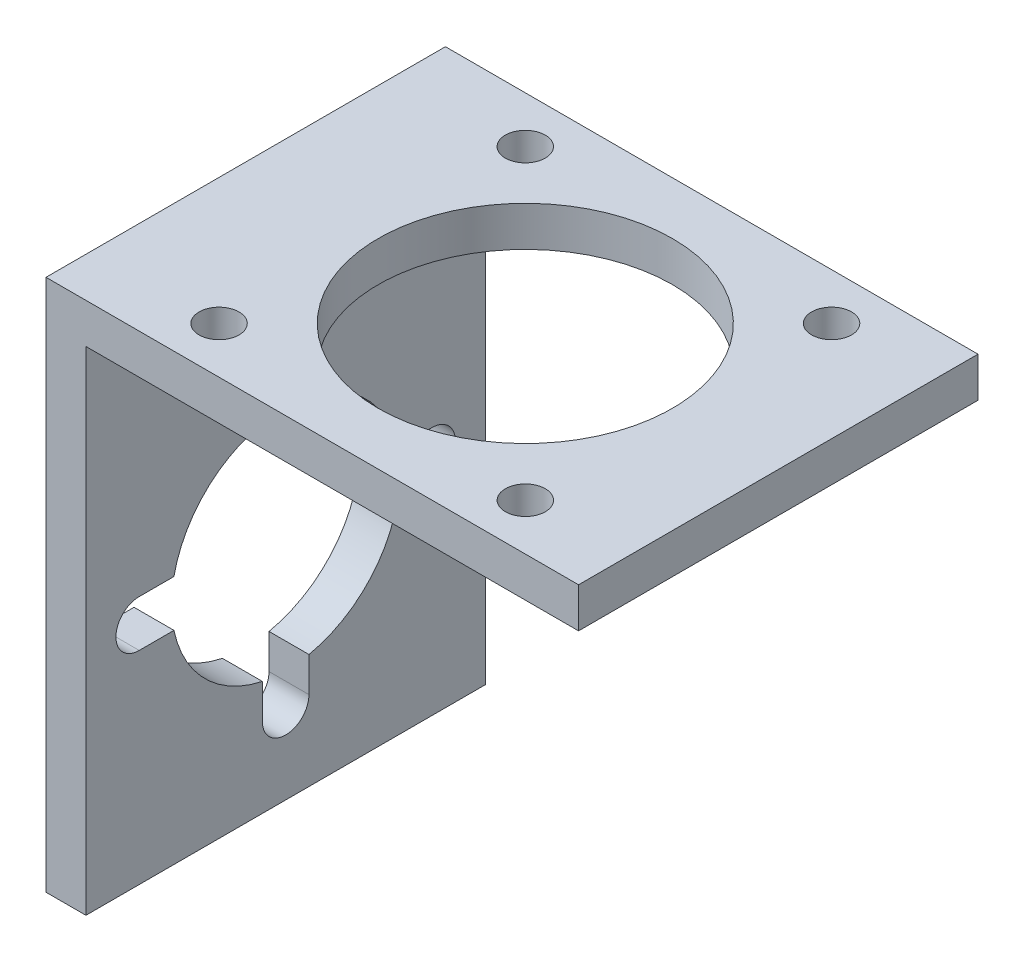
ISO-10303-21;
HEADER;
FILE_DESCRIPTION(('STEP AP214'),'2;1');
FILE_NAME('part.step','',(''),(''),'','','');
FILE_SCHEMA(('AUTOMOTIVE_DESIGN { 1 0 10303 214 1 1 1 1 }'));
ENDSEC;
DATA;
#1=APPLICATION_CONTEXT('core data for automotive mechanical design processes');
#2=APPLICATION_PROTOCOL_DEFINITION('international standard','automotive_design',2000,#1);
#3=PRODUCT_CONTEXT('',#1,'mechanical');
#4=PRODUCT('Part','Part','',(#3));
#5=PRODUCT_RELATED_PRODUCT_CATEGORY('part','',(#4));
#6=PRODUCT_DEFINITION_FORMATION('','',#4);
#7=PRODUCT_DEFINITION_CONTEXT('part definition',#1,'design');
#8=PRODUCT_DEFINITION('design','',#6,#7);
#9=PRODUCT_DEFINITION_SHAPE('','',#8);
#10=(LENGTH_UNIT() NAMED_UNIT(*) SI_UNIT(.MILLI.,.METRE.));
#11=(NAMED_UNIT(*) PLANE_ANGLE_UNIT() SI_UNIT($,.RADIAN.));
#12=(NAMED_UNIT(*) SI_UNIT($,.STERADIAN.) SOLID_ANGLE_UNIT());
#13=UNCERTAINTY_MEASURE_WITH_UNIT(LENGTH_MEASURE(1.E-05),#10,'distance_accuracy_value','');
#14=(GEOMETRIC_REPRESENTATION_CONTEXT(3) GLOBAL_UNCERTAINTY_ASSIGNED_CONTEXT((#13)) GLOBAL_UNIT_ASSIGNED_CONTEXT((#10,
#11,#12)) REPRESENTATION_CONTEXT('',''));
#15=CARTESIAN_POINT('',(0.,0.,0.));
#16=DIRECTION('',(0.,0.,1.));
#17=DIRECTION('',(1.,0.,0.));
#18=AXIS2_PLACEMENT_3D('',#15,#16,#17);
#19=CARTESIAN_POINT('',(0.,-3.,30.));
#20=DIRECTION('',(1.,0.,0.));
#21=DIRECTION('',(0.,1.,0.));
#22=AXIS2_PLACEMENT_3D('',#19,#20,#21);
#23=PLANE('',#22);
#24=DIRECTION('',(0.,0.,1.));
#25=VECTOR('',#24,1.);
#26=CARTESIAN_POINT('',(0.,-21.27,26.));
#27=LINE('',#26,#25);
#28=CARTESIAN_POINT('',(0.,-21.27,23.3894219109543));
#29=VERTEX_POINT('',#28);
#30=CARTESIAN_POINT('',(0.,-21.27,26.));
#31=VERTEX_POINT('',#30);
#32=EDGE_CURVE('E191',#29,#31,#27,.T.);
#33=ORIENTED_EDGE('',*,*,#32,.T.);
#34=CARTESIAN_POINT('',(0.,-23.02,26.));
#35=DIRECTION('',(1.,0.,0.));
#36=DIRECTION('',(0.,1.,0.));
#37=AXIS2_PLACEMENT_3D('',#34,#35,#36);
#38=CIRCLE('',#37,1.75);
#39=CARTESIAN_POINT('',(0.,-24.77,26.));
#40=VERTEX_POINT('',#39);
#41=EDGE_CURVE('E185',#31,#40,#38,.T.);
#42=ORIENTED_EDGE('',*,*,#41,.T.);
#43=DIRECTION('',(0.,0.,-1.));
#44=VECTOR('',#43,1.);
#45=CARTESIAN_POINT('',(0.,-24.77,26.));
#46=LINE('',#45,#44);
#47=CARTESIAN_POINT('',(0.,-24.77,23.3894219109543));
#48=VERTEX_POINT('',#47);
#49=EDGE_CURVE('E194',#40,#48,#46,.T.);
#50=ORIENTED_EDGE('',*,*,#49,.T.);
#51=CARTESIAN_POINT('',(0.,-23.02,15.));
#52=DIRECTION('',(1.,0.,0.));
#53=DIRECTION('',(0.,1.,0.));
#54=AXIS2_PLACEMENT_3D('',#51,#52,#53);
#55=CIRCLE('',#54,8.57);
#56=CARTESIAN_POINT('',(0.,-31.4094219109543,16.7499999999999));
#57=VERTEX_POINT('',#56);
#58=EDGE_CURVE('E49',#48,#57,#55,.T.);
#59=ORIENTED_EDGE('',*,*,#58,.T.);
#60=DIRECTION('',(0.,-1.,0.));
#61=VECTOR('',#60,1.);
#62=CARTESIAN_POINT('',(0.,-34.02,16.75));
#63=LINE('',#62,#61);
#64=CARTESIAN_POINT('',(0.,-34.02,16.75));
#65=VERTEX_POINT('',#64);
#66=EDGE_CURVE('E208',#57,#65,#63,.T.);
#67=ORIENTED_EDGE('',*,*,#66,.T.);
#68=CARTESIAN_POINT('',(0.,-34.02,15.));
#69=DIRECTION('',(1.,0.,0.));
#70=DIRECTION('',(0.,1.,0.));
#71=AXIS2_PLACEMENT_3D('',#68,#69,#70);
#72=CIRCLE('',#71,1.75);
#73=CARTESIAN_POINT('',(0.,-34.02,13.25));
#74=VERTEX_POINT('',#73);
#75=EDGE_CURVE('E211',#65,#74,#72,.T.);
#76=ORIENTED_EDGE('',*,*,#75,.T.);
#77=DIRECTION('',(0.,1.,0.));
#78=VECTOR('',#77,1.);
#79=CARTESIAN_POINT('',(0.,-34.02,13.25));
#80=LINE('',#79,#78);
#81=CARTESIAN_POINT('',(0.,-31.4094219109543,13.2499999999999));
#82=VERTEX_POINT('',#81);
#83=EDGE_CURVE('E214',#74,#82,#80,.T.);
#84=ORIENTED_EDGE('',*,*,#83,.T.);
#85=CARTESIAN_POINT('',(0.,-23.02,15.));
#86=DIRECTION('',(1.,0.,0.));
#87=DIRECTION('',(0.,1.,0.));
#88=AXIS2_PLACEMENT_3D('',#85,#86,#87);
#89=CIRCLE('',#88,8.57);
#90=CARTESIAN_POINT('',(0.,-24.77,6.6105780890457));
#91=VERTEX_POINT('',#90);
#92=EDGE_CURVE('E217',#82,#91,#89,.T.);
#93=ORIENTED_EDGE('',*,*,#92,.T.);
#94=DIRECTION('',(0.,0.,-1.));
#95=VECTOR('',#94,1.);
#96=CARTESIAN_POINT('',(0.,-24.7700000000001,4.00000000000001));
#97=LINE('',#96,#95);
#98=CARTESIAN_POINT('',(0.,-24.7700000000001,4.00000000000001));
#99=VERTEX_POINT('',#98);
#100=EDGE_CURVE('E220',#91,#99,#97,.T.);
#101=ORIENTED_EDGE('',*,*,#100,.T.);
#102=CARTESIAN_POINT('',(0.,-23.0200000000001,4.00000000000001));
#103=DIRECTION('',(1.,0.,0.));
#104=DIRECTION('',(0.,1.,0.));
#105=AXIS2_PLACEMENT_3D('',#102,#103,#104);
#106=CIRCLE('',#105,1.75);
#107=CARTESIAN_POINT('',(0.,-21.2700000000001,4.00000000000001));
#108=VERTEX_POINT('',#107);
#109=EDGE_CURVE('E223',#99,#108,#106,.T.);
#110=ORIENTED_EDGE('',*,*,#109,.T.);
#111=DIRECTION('',(0.,0.,1.));
#112=VECTOR('',#111,1.);
#113=CARTESIAN_POINT('',(0.,-21.2700000000001,4.00000000000001));
#114=LINE('',#113,#112);
#115=CARTESIAN_POINT('',(0.,-21.27,6.61057808904571));
#116=VERTEX_POINT('',#115);
#117=EDGE_CURVE('E226',#108,#116,#114,.T.);
#118=ORIENTED_EDGE('',*,*,#117,.T.);
#119=CARTESIAN_POINT('',(0.,-23.02,15.));
#120=DIRECTION('',(1.,0.,0.));
#121=DIRECTION('',(0.,1.,0.));
#122=AXIS2_PLACEMENT_3D('',#119,#120,#121);
#123=CIRCLE('',#122,8.57);
#124=CARTESIAN_POINT('',(0.,-14.6305780890457,13.2499999999999));
#125=VERTEX_POINT('',#124);
#126=EDGE_CURVE('E229',#116,#125,#123,.T.);
#127=ORIENTED_EDGE('',*,*,#126,.T.);
#128=DIRECTION('',(0.,1.,0.));
#129=VECTOR('',#128,1.);
#130=CARTESIAN_POINT('',(0.,-12.02,13.2499999999999));
#131=LINE('',#130,#129);
#132=CARTESIAN_POINT('',(0.,-12.02,13.2499999999999));
#133=VERTEX_POINT('',#132);
#134=EDGE_CURVE('E232',#125,#133,#131,.T.);
#135=ORIENTED_EDGE('',*,*,#134,.T.);
#136=CARTESIAN_POINT('',(0.,-12.02,14.9999999999999));
#137=DIRECTION('',(1.,0.,0.));
#138=DIRECTION('',(0.,1.,0.));
#139=AXIS2_PLACEMENT_3D('',#136,#137,#138);
#140=CIRCLE('',#139,1.75);
#141=CARTESIAN_POINT('',(0.,-12.02,16.7499999999999));
#142=VERTEX_POINT('',#141);
#143=EDGE_CURVE('E235',#133,#142,#140,.T.);
#144=ORIENTED_EDGE('',*,*,#143,.T.);
#145=DIRECTION('',(0.,-1.,0.));
#146=VECTOR('',#145,1.);
#147=CARTESIAN_POINT('',(0.,-12.02,16.7499999999999));
#148=LINE('',#147,#146);
#149=CARTESIAN_POINT('',(0.,-14.6305780890457,16.7499999999999));
#150=VERTEX_POINT('',#149);
#151=EDGE_CURVE('E238',#142,#150,#148,.T.);
#152=ORIENTED_EDGE('',*,*,#151,.T.);
#153=CARTESIAN_POINT('',(0.,-23.02,15.));
#154=DIRECTION('',(1.,0.,0.));
#155=DIRECTION('',(0.,1.,0.));
#156=AXIS2_PLACEMENT_3D('',#153,#154,#155);
#157=CIRCLE('',#156,8.57);
#158=EDGE_CURVE('E241',#150,#29,#157,.T.);
#159=ORIENTED_EDGE('',*,*,#158,.T.);
#160=EDGE_LOOP('',(#33,#42,#50,#59,#67,#76,#84,#93,#101,#110,#118,#127,#135,#144,#152,#159));
#161=FACE_BOUND('',#160,.T.);
#162=DIRECTION('',(0.,-1.,0.));
#163=VECTOR('',#162,1.);
#164=CARTESIAN_POINT('',(0.,-3.,0.));
#165=LINE('',#164,#163);
#166=CARTESIAN_POINT('',(0.,0.,0.));
#167=VERTEX_POINT('',#166);
#168=CARTESIAN_POINT('',(0.,-40.,0.));
#169=VERTEX_POINT('',#168);
#170=EDGE_CURVE('E342',#167,#169,#165,.T.);
#171=ORIENTED_EDGE('',*,*,#170,.T.);
#172=DIRECTION('',(0.,0.,-1.));
#173=VECTOR('',#172,1.);
#174=CARTESIAN_POINT('',(0.,-40.,30.));
#175=LINE('',#174,#173);
#176=CARTESIAN_POINT('',(0.,-40.,30.));
#177=VERTEX_POINT('',#176);
#178=EDGE_CURVE('E11',#177,#169,#175,.T.);
#179=ORIENTED_EDGE('',*,*,#178,.F.);
#180=DIRECTION('',(0.,-1.,0.));
#181=VECTOR('',#180,1.);
#182=CARTESIAN_POINT('',(0.,0.,30.));
#183=LINE('',#182,#181);
#184=CARTESIAN_POINT('',(0.,0.,30.));
#185=VERTEX_POINT('',#184);
#186=EDGE_CURVE('E345',#185,#177,#183,.T.);
#187=ORIENTED_EDGE('',*,*,#186,.F.);
#188=DIRECTION('',(0.,0.,-1.));
#189=VECTOR('',#188,1.);
#190=CARTESIAN_POINT('',(0.,0.,30.));
#191=LINE('',#190,#189);
#192=EDGE_CURVE('E358',#185,#167,#191,.T.);
#193=ORIENTED_EDGE('',*,*,#192,.T.);
#194=EDGE_LOOP('',(#171,#179,#187,#193));
#195=FACE_BOUND('',#194,.T.);
#196=ADVANCED_FACE('F35',(#161,#195),#23,.F.);
#197=CARTESIAN_POINT('',(0.,-40.,30.));
#198=DIRECTION('',(0.,1.,0.));
#199=DIRECTION('',(0.,0.,1.));
#200=AXIS2_PLACEMENT_3D('',#197,#198,#199);
#201=PLANE('',#200);
#202=DIRECTION('',(1.,0.,0.));
#203=VECTOR('',#202,1.);
#204=CARTESIAN_POINT('',(0.,-40.,0.));
#205=LINE('',#204,#203);
#206=CARTESIAN_POINT('',(3.00000000000001,-40.,0.));
#207=VERTEX_POINT('',#206);
#208=EDGE_CURVE('E360',#169,#207,#205,.T.);
#209=ORIENTED_EDGE('',*,*,#208,.T.);
#210=DIRECTION('',(0.,0.,-1.));
#211=VECTOR('',#210,1.);
#212=CARTESIAN_POINT('',(3.00000000000001,-40.,30.));
#213=LINE('',#212,#211);
#214=CARTESIAN_POINT('',(3.00000000000001,-40.,30.));
#215=VERTEX_POINT('',#214);
#216=EDGE_CURVE('E42',#215,#207,#213,.T.);
#217=ORIENTED_EDGE('',*,*,#216,.F.);
#218=DIRECTION('',(1.,0.,0.));
#219=VECTOR('',#218,1.);
#220=CARTESIAN_POINT('',(0.,-40.,30.));
#221=LINE('',#220,#219);
#222=EDGE_CURVE('E347',#177,#215,#221,.T.);
#223=ORIENTED_EDGE('',*,*,#222,.F.);
#224=ORIENTED_EDGE('',*,*,#178,.T.);
#225=EDGE_LOOP('',(#209,#217,#223,#224));
#226=FACE_BOUND('',#225,.T.);
#227=ADVANCED_FACE('F409',(#226),#201,.F.);
#228=CARTESIAN_POINT('',(3.,-3.,30.));
#229=DIRECTION('',(-1.,0.,0.));
#230=DIRECTION('',(0.,-1.,0.));
#231=AXIS2_PLACEMENT_3D('',#228,#229,#230);
#232=PLANE('',#231);
#233=DIRECTION('',(0.,0.,-1.));
#234=VECTOR('',#233,1.);
#235=CARTESIAN_POINT('',(3.,-24.77,26.));
#236=LINE('',#235,#234);
#237=CARTESIAN_POINT('',(3.,-24.77,26.));
#238=VERTEX_POINT('',#237);
#239=CARTESIAN_POINT('',(3.,-24.77,23.3894219109543));
#240=VERTEX_POINT('',#239);
#241=EDGE_CURVE('E245',#238,#240,#236,.T.);
#242=ORIENTED_EDGE('',*,*,#241,.F.);
#243=CARTESIAN_POINT('',(3.,-23.02,26.));
#244=DIRECTION('',(1.,0.,0.));
#245=DIRECTION('',(0.,1.,0.));
#246=AXIS2_PLACEMENT_3D('',#243,#244,#245);
#247=CIRCLE('',#246,1.75);
#248=CARTESIAN_POINT('',(3.,-21.27,26.));
#249=VERTEX_POINT('',#248);
#250=EDGE_CURVE('E57',#249,#238,#247,.T.);
#251=ORIENTED_EDGE('',*,*,#250,.F.);
#252=DIRECTION('',(0.,0.,1.));
#253=VECTOR('',#252,1.);
#254=CARTESIAN_POINT('',(3.,-21.27,26.));
#255=LINE('',#254,#253);
#256=CARTESIAN_POINT('',(3.,-21.27,23.3894219109543));
#257=VERTEX_POINT('',#256);
#258=EDGE_CURVE('E201',#257,#249,#255,.T.);
#259=ORIENTED_EDGE('',*,*,#258,.F.);
#260=CARTESIAN_POINT('',(3.,-23.02,15.));
#261=DIRECTION('',(1.,0.,0.));
#262=DIRECTION('',(0.,1.,0.));
#263=AXIS2_PLACEMENT_3D('',#260,#261,#262);
#264=CIRCLE('',#263,8.57);
#265=CARTESIAN_POINT('',(3.,-14.6305780890457,16.7499999999999));
#266=VERTEX_POINT('',#265);
#267=EDGE_CURVE('E204',#266,#257,#264,.T.);
#268=ORIENTED_EDGE('',*,*,#267,.F.);
#269=DIRECTION('',(0.,-1.,0.));
#270=VECTOR('',#269,1.);
#271=CARTESIAN_POINT('',(3.,-12.02,16.7499999999999));
#272=LINE('',#271,#270);
#273=CARTESIAN_POINT('',(3.,-12.02,16.7499999999999));
#274=VERTEX_POINT('',#273);
#275=EDGE_CURVE('E280',#274,#266,#272,.T.);
#276=ORIENTED_EDGE('',*,*,#275,.F.);
#277=CARTESIAN_POINT('',(3.,-12.02,14.9999999999999));
#278=DIRECTION('',(1.,0.,0.));
#279=DIRECTION('',(0.,1.,0.));
#280=AXIS2_PLACEMENT_3D('',#277,#278,#279);
#281=CIRCLE('',#280,1.75);
#282=CARTESIAN_POINT('',(3.,-12.02,13.2499999999999));
#283=VERTEX_POINT('',#282);
#284=EDGE_CURVE('E277',#283,#274,#281,.T.);
#285=ORIENTED_EDGE('',*,*,#284,.F.);
#286=DIRECTION('',(0.,1.,0.));
#287=VECTOR('',#286,1.);
#288=CARTESIAN_POINT('',(3.,-12.02,13.2499999999999));
#289=LINE('',#288,#287);
#290=CARTESIAN_POINT('',(3.,-14.6305780890457,13.2499999999999));
#291=VERTEX_POINT('',#290);
#292=EDGE_CURVE('E274',#291,#283,#289,.T.);
#293=ORIENTED_EDGE('',*,*,#292,.F.);
#294=CARTESIAN_POINT('',(3.,-23.02,15.));
#295=DIRECTION('',(1.,0.,0.));
#296=DIRECTION('',(0.,1.,0.));
#297=AXIS2_PLACEMENT_3D('',#294,#295,#296);
#298=CIRCLE('',#297,8.57);
#299=CARTESIAN_POINT('',(3.,-21.27,6.61057808904571));
#300=VERTEX_POINT('',#299);
#301=EDGE_CURVE('E271',#300,#291,#298,.T.);
#302=ORIENTED_EDGE('',*,*,#301,.F.);
#303=DIRECTION('',(0.,0.,1.));
#304=VECTOR('',#303,1.);
#305=CARTESIAN_POINT('',(3.,-21.2700000000001,4.00000000000001));
#306=LINE('',#305,#304);
#307=CARTESIAN_POINT('',(3.,-21.2700000000001,4.00000000000001));
#308=VERTEX_POINT('',#307);
#309=EDGE_CURVE('E268',#308,#300,#306,.T.);
#310=ORIENTED_EDGE('',*,*,#309,.F.);
#311=CARTESIAN_POINT('',(3.,-23.0200000000001,4.00000000000001));
#312=DIRECTION('',(1.,0.,0.));
#313=DIRECTION('',(0.,1.,0.));
#314=AXIS2_PLACEMENT_3D('',#311,#312,#313);
#315=CIRCLE('',#314,1.75);
#316=CARTESIAN_POINT('',(3.,-24.7700000000001,4.00000000000001));
#317=VERTEX_POINT('',#316);
#318=EDGE_CURVE('E265',#317,#308,#315,.T.);
#319=ORIENTED_EDGE('',*,*,#318,.F.);
#320=DIRECTION('',(0.,0.,-1.));
#321=VECTOR('',#320,1.);
#322=CARTESIAN_POINT('',(3.,-24.7700000000001,4.00000000000001));
#323=LINE('',#322,#321);
#324=CARTESIAN_POINT('',(3.,-24.77,6.6105780890457));
#325=VERTEX_POINT('',#324);
#326=EDGE_CURVE('E262',#325,#317,#323,.T.);
#327=ORIENTED_EDGE('',*,*,#326,.F.);
#328=CARTESIAN_POINT('',(3.,-23.02,15.));
#329=DIRECTION('',(1.,0.,0.));
#330=DIRECTION('',(0.,1.,0.));
#331=AXIS2_PLACEMENT_3D('',#328,#329,#330);
#332=CIRCLE('',#331,8.57);
#333=CARTESIAN_POINT('',(3.,-31.4094219109543,13.2499999999999));
#334=VERTEX_POINT('',#333);
#335=EDGE_CURVE('E259',#334,#325,#332,.T.);
#336=ORIENTED_EDGE('',*,*,#335,.F.);
#337=DIRECTION('',(0.,1.,0.));
#338=VECTOR('',#337,1.);
#339=CARTESIAN_POINT('',(3.,-34.02,13.25));
#340=LINE('',#339,#338);
#341=CARTESIAN_POINT('',(3.,-34.02,13.25));
#342=VERTEX_POINT('',#341);
#343=EDGE_CURVE('E256',#342,#334,#340,.T.);
#344=ORIENTED_EDGE('',*,*,#343,.F.);
#345=CARTESIAN_POINT('',(3.,-34.02,15.));
#346=DIRECTION('',(1.,0.,0.));
#347=DIRECTION('',(0.,1.,0.));
#348=AXIS2_PLACEMENT_3D('',#345,#346,#347);
#349=CIRCLE('',#348,1.75);
#350=CARTESIAN_POINT('',(3.,-34.02,16.75));
#351=VERTEX_POINT('',#350);
#352=EDGE_CURVE('E253',#351,#342,#349,.T.);
#353=ORIENTED_EDGE('',*,*,#352,.F.);
#354=DIRECTION('',(0.,-1.,0.));
#355=VECTOR('',#354,1.);
#356=CARTESIAN_POINT('',(3.,-34.02,16.75));
#357=LINE('',#356,#355);
#358=CARTESIAN_POINT('',(3.,-31.4094219109543,16.7499999999999));
#359=VERTEX_POINT('',#358);
#360=EDGE_CURVE('E250',#359,#351,#357,.T.);
#361=ORIENTED_EDGE('',*,*,#360,.F.);
#362=CARTESIAN_POINT('',(3.,-23.02,15.));
#363=DIRECTION('',(1.,0.,0.));
#364=DIRECTION('',(0.,1.,0.));
#365=AXIS2_PLACEMENT_3D('',#362,#363,#364);
#366=CIRCLE('',#365,8.57);
#367=EDGE_CURVE('E247',#240,#359,#366,.T.);
#368=ORIENTED_EDGE('',*,*,#367,.F.);
#369=EDGE_LOOP('',(#242,#251,#259,#268,#276,#285,#293,#302,#310,#319,#327,#336,#344,#353,#361,#368));
#370=FACE_BOUND('',#369,.T.);
#371=DIRECTION('',(0.,1.,0.));
#372=VECTOR('',#371,1.);
#373=CARTESIAN_POINT('',(3.,-3.,0.));
#374=LINE('',#373,#372);
#375=CARTESIAN_POINT('',(3.,-3.,0.));
#376=VERTEX_POINT('',#375);
#377=EDGE_CURVE('E362',#207,#376,#374,.T.);
#378=ORIENTED_EDGE('',*,*,#377,.T.);
#379=DIRECTION('',(0.,0.,-1.));
#380=VECTOR('',#379,1.);
#381=CARTESIAN_POINT('',(3.,-3.,30.));
#382=LINE('',#381,#380);
#383=CARTESIAN_POINT('',(3.,-3.,30.));
#384=VERTEX_POINT('',#383);
#385=EDGE_CURVE('E378',#384,#376,#382,.T.);
#386=ORIENTED_EDGE('',*,*,#385,.F.);
#387=DIRECTION('',(0.,1.,0.));
#388=VECTOR('',#387,1.);
#389=CARTESIAN_POINT('',(3.,-3.,30.));
#390=LINE('',#389,#388);
#391=EDGE_CURVE('E350',#215,#384,#390,.T.);
#392=ORIENTED_EDGE('',*,*,#391,.F.);
#393=ORIENTED_EDGE('',*,*,#216,.T.);
#394=EDGE_LOOP('',(#378,#386,#392,#393));
#395=FACE_BOUND('',#394,.T.);
#396=ADVANCED_FACE('F385',(#370,#395),#232,.F.);
#397=CARTESIAN_POINT('',(3.,-3.,30.));
#398=DIRECTION('',(0.,1.,0.));
#399=DIRECTION('',(0.,0.,1.));
#400=AXIS2_PLACEMENT_3D('',#397,#398,#399);
#401=PLANE('',#400);
#402=CARTESIAN_POINT('',(9.50000000000012,-3.,26.5021834883641));
#403=DIRECTION('',(0.,-1.,0.));
#404=DIRECTION('',(0.,0.,-1.));
#405=AXIS2_PLACEMENT_3D('',#402,#403,#404);
#406=CIRCLE('',#405,1.50000000000001);
#407=CARTESIAN_POINT('',(9.50000000000012,-3.,25.0021834883641));
#408=VERTEX_POINT('',#407);
#409=EDGE_CURVE('E287',#408,#408,#406,.T.);
#410=ORIENTED_EDGE('',*,*,#409,.F.);
#411=EDGE_LOOP('',(#410));
#412=FACE_BOUND('',#411,.T.);
#413=CARTESIAN_POINT('',(9.49781651163593,-3.,3.49999999999975));
#414=DIRECTION('',(0.,-1.,0.));
#415=DIRECTION('',(0.,0.,-1.));
#416=AXIS2_PLACEMENT_3D('',#413,#414,#415);
#417=CIRCLE('',#416,1.5);
#418=CARTESIAN_POINT('',(9.49781651163593,-3.,1.99999999999975));
#419=VERTEX_POINT('',#418);
#420=EDGE_CURVE('E318',#419,#419,#417,.T.);
#421=ORIENTED_EDGE('',*,*,#420,.F.);
#422=EDGE_LOOP('',(#421));
#423=FACE_BOUND('',#422,.T.);
#424=CARTESIAN_POINT('',(32.5000000000003,-3.,3.49781651163567));
#425=DIRECTION('',(0.,-1.,0.));
#426=DIRECTION('',(0.,0.,-1.));
#427=AXIS2_PLACEMENT_3D('',#424,#425,#426);
#428=CIRCLE('',#427,1.50000000000001);
#429=CARTESIAN_POINT('',(32.5000000000003,-3.,1.99781651163566));
#430=VERTEX_POINT('',#429);
#431=EDGE_CURVE('E324',#430,#430,#428,.T.);
#432=ORIENTED_EDGE('',*,*,#431,.F.);
#433=EDGE_LOOP('',(#432));
#434=FACE_BOUND('',#433,.T.);
#435=CARTESIAN_POINT('',(32.5021834883643,-3.,26.5));
#436=DIRECTION('',(0.,-1.,0.));
#437=DIRECTION('',(0.,0.,-1.));
#438=AXIS2_PLACEMENT_3D('',#435,#436,#437);
#439=CIRCLE('',#438,1.5);
#440=CARTESIAN_POINT('',(32.5021834883643,-3.,25.));
#441=VERTEX_POINT('',#440);
#442=EDGE_CURVE('E330',#441,#441,#439,.T.);
#443=ORIENTED_EDGE('',*,*,#442,.F.);
#444=EDGE_LOOP('',(#443));
#445=FACE_BOUND('',#444,.T.);
#446=CARTESIAN_POINT('',(21.,-3.,15.));
#447=DIRECTION('',(0.,-1.,0.));
#448=DIRECTION('',(0.,0.,-1.));
#449=AXIS2_PLACEMENT_3D('',#446,#447,#448);
#450=CIRCLE('',#449,11.05);
#451=CARTESIAN_POINT('',(21.,-3.,3.95));
#452=VERTEX_POINT('',#451);
#453=EDGE_CURVE('E336',#452,#452,#450,.T.);
#454=ORIENTED_EDGE('',*,*,#453,.F.);
#455=EDGE_LOOP('',(#454));
#456=FACE_BOUND('',#455,.T.);
#457=DIRECTION('',(1.,0.,0.));
#458=VECTOR('',#457,1.);
#459=CARTESIAN_POINT('',(3.,-3.,0.));
#460=LINE('',#459,#458);
#461=CARTESIAN_POINT('',(40.,-3.,0.));
#462=VERTEX_POINT('',#461);
#463=EDGE_CURVE('E364',#376,#462,#460,.T.);
#464=ORIENTED_EDGE('',*,*,#463,.T.);
#465=DIRECTION('',(0.,0.,-1.));
#466=VECTOR('',#465,1.);
#467=CARTESIAN_POINT('',(40.,-3.,30.));
#468=LINE('',#467,#466);
#469=CARTESIAN_POINT('',(40.,-3.,30.));
#470=VERTEX_POINT('',#469);
#471=EDGE_CURVE('E375',#470,#462,#468,.T.);
#472=ORIENTED_EDGE('',*,*,#471,.F.);
#473=DIRECTION('',(1.,0.,0.));
#474=VECTOR('',#473,1.);
#475=CARTESIAN_POINT('',(3.,-3.,30.));
#476=LINE('',#475,#474);
#477=EDGE_CURVE('E352',#384,#470,#476,.T.);
#478=ORIENTED_EDGE('',*,*,#477,.F.);
#479=ORIENTED_EDGE('',*,*,#385,.T.);
#480=EDGE_LOOP('',(#464,#472,#478,#479));
#481=FACE_BOUND('',#480,.T.);
#482=ADVANCED_FACE('F397',(#412,#423,#434,#445,#456,#481),#401,.F.);
#483=CARTESIAN_POINT('',(40.,0.,30.));
#484=DIRECTION('',(-1.,0.,0.));
#485=DIRECTION('',(0.,0.,1.));
#486=AXIS2_PLACEMENT_3D('',#483,#484,#485);
#487=PLANE('',#486);
#488=DIRECTION('',(0.,1.,0.));
#489=VECTOR('',#488,1.);
#490=CARTESIAN_POINT('',(40.,0.,0.));
#491=LINE('',#490,#489);
#492=CARTESIAN_POINT('',(40.,0.,0.));
#493=VERTEX_POINT('',#492);
#494=EDGE_CURVE('E366',#462,#493,#491,.T.);
#495=ORIENTED_EDGE('',*,*,#494,.T.);
#496=DIRECTION('',(0.,0.,-1.));
#497=VECTOR('',#496,1.);
#498=CARTESIAN_POINT('',(40.,0.,30.));
#499=LINE('',#498,#497);
#500=CARTESIAN_POINT('',(40.,0.,30.));
#501=VERTEX_POINT('',#500);
#502=EDGE_CURVE('E372',#501,#493,#499,.T.);
#503=ORIENTED_EDGE('',*,*,#502,.F.);
#504=DIRECTION('',(0.,1.,0.));
#505=VECTOR('',#504,1.);
#506=CARTESIAN_POINT('',(40.,0.,30.));
#507=LINE('',#506,#505);
#508=EDGE_CURVE('E354',#470,#501,#507,.T.);
#509=ORIENTED_EDGE('',*,*,#508,.F.);
#510=ORIENTED_EDGE('',*,*,#471,.T.);
#511=EDGE_LOOP('',(#495,#503,#509,#510));
#512=FACE_BOUND('',#511,.T.);
#513=ADVANCED_FACE('F401',(#512),#487,.F.);
#514=CARTESIAN_POINT('',(0.,0.,30.));
#515=DIRECTION('',(0.,-1.,0.));
#516=DIRECTION('',(0.,0.,-1.));
#517=AXIS2_PLACEMENT_3D('',#514,#515,#516);
#518=PLANE('',#517);
#519=CARTESIAN_POINT('',(9.50000000000012,0.,26.5021834883641));
#520=DIRECTION('',(0.,-1.,0.));
#521=DIRECTION('',(0.,0.,-1.));
#522=AXIS2_PLACEMENT_3D('',#519,#520,#521);
#523=CIRCLE('',#522,1.50000000000001);
#524=CARTESIAN_POINT('',(9.50000000000012,0.,25.0021834883641));
#525=VERTEX_POINT('',#524);
#526=EDGE_CURVE('E315',#525,#525,#523,.T.);
#527=ORIENTED_EDGE('',*,*,#526,.T.);
#528=EDGE_LOOP('',(#527));
#529=FACE_BOUND('',#528,.T.);
#530=CARTESIAN_POINT('',(9.49781651163593,0.,3.49999999999975));
#531=DIRECTION('',(0.,-1.,0.));
#532=DIRECTION('',(0.,0.,-1.));
#533=AXIS2_PLACEMENT_3D('',#530,#531,#532);
#534=CIRCLE('',#533,1.5);
#535=CARTESIAN_POINT('',(9.49781651163593,0.,1.99999999999975));
#536=VERTEX_POINT('',#535);
#537=EDGE_CURVE('E321',#536,#536,#534,.T.);
#538=ORIENTED_EDGE('',*,*,#537,.T.);
#539=EDGE_LOOP('',(#538));
#540=FACE_BOUND('',#539,.T.);
#541=CARTESIAN_POINT('',(32.5000000000003,0.,3.49781651163567));
#542=DIRECTION('',(0.,-1.,0.));
#543=DIRECTION('',(0.,0.,-1.));
#544=AXIS2_PLACEMENT_3D('',#541,#542,#543);
#545=CIRCLE('',#544,1.50000000000001);
#546=CARTESIAN_POINT('',(32.5000000000003,0.,1.99781651163566));
#547=VERTEX_POINT('',#546);
#548=EDGE_CURVE('E327',#547,#547,#545,.T.);
#549=ORIENTED_EDGE('',*,*,#548,.T.);
#550=EDGE_LOOP('',(#549));
#551=FACE_BOUND('',#550,.T.);
#552=CARTESIAN_POINT('',(32.5021834883643,0.,26.5));
#553=DIRECTION('',(0.,-1.,0.));
#554=DIRECTION('',(0.,0.,-1.));
#555=AXIS2_PLACEMENT_3D('',#552,#553,#554);
#556=CIRCLE('',#555,1.5);
#557=CARTESIAN_POINT('',(32.5021834883643,0.,25.));
#558=VERTEX_POINT('',#557);
#559=EDGE_CURVE('E333',#558,#558,#556,.T.);
#560=ORIENTED_EDGE('',*,*,#559,.T.);
#561=EDGE_LOOP('',(#560));
#562=FACE_BOUND('',#561,.T.);
#563=CARTESIAN_POINT('',(21.,0.,15.));
#564=DIRECTION('',(0.,-1.,0.));
#565=DIRECTION('',(0.,0.,-1.));
#566=AXIS2_PLACEMENT_3D('',#563,#564,#565);
#567=CIRCLE('',#566,11.05);
#568=CARTESIAN_POINT('',(21.,0.,3.95));
#569=VERTEX_POINT('',#568);
#570=EDGE_CURVE('E339',#569,#569,#567,.T.);
#571=ORIENTED_EDGE('',*,*,#570,.T.);
#572=EDGE_LOOP('',(#571));
#573=FACE_BOUND('',#572,.T.);
#574=DIRECTION('',(-1.,0.,0.));
#575=VECTOR('',#574,1.);
#576=CARTESIAN_POINT('',(0.,0.,0.));
#577=LINE('',#576,#575);
#578=EDGE_CURVE('E348',#493,#167,#577,.T.);
#579=ORIENTED_EDGE('',*,*,#578,.T.);
#580=ORIENTED_EDGE('',*,*,#192,.F.);
#581=DIRECTION('',(-1.,0.,0.));
#582=VECTOR('',#581,1.);
#583=CARTESIAN_POINT('',(0.,0.,30.));
#584=LINE('',#583,#582);
#585=EDGE_CURVE('E356',#501,#185,#584,.T.);
#586=ORIENTED_EDGE('',*,*,#585,.F.);
#587=ORIENTED_EDGE('',*,*,#502,.T.);
#588=EDGE_LOOP('',(#579,#580,#586,#587));
#589=FACE_BOUND('',#588,.T.);
#590=ADVANCED_FACE('F411',(#529,#540,#551,#562,#573,#589),#518,.F.);
#591=CARTESIAN_POINT('',(0.,0.,30.));
#592=DIRECTION('',(0.,0.,1.));
#593=DIRECTION('',(1.,0.,0.));
#594=AXIS2_PLACEMENT_3D('',#591,#592,#593);
#595=PLANE('',#594);
#596=ORIENTED_EDGE('',*,*,#186,.T.);
#597=ORIENTED_EDGE('',*,*,#222,.T.);
#598=ORIENTED_EDGE('',*,*,#391,.T.);
#599=ORIENTED_EDGE('',*,*,#477,.T.);
#600=ORIENTED_EDGE('',*,*,#508,.T.);
#601=ORIENTED_EDGE('',*,*,#585,.T.);
#602=EDGE_LOOP('',(#596,#597,#598,#599,#600,#601));
#603=FACE_BOUND('',#602,.T.);
#604=ADVANCED_FACE('F405',(#603),#595,.T.);
#605=CARTESIAN_POINT('',(0.,0.,0.));
#606=DIRECTION('',(0.,0.,1.));
#607=DIRECTION('',(1.,0.,0.));
#608=AXIS2_PLACEMENT_3D('',#605,#606,#607);
#609=PLANE('',#608);
#610=ORIENTED_EDGE('',*,*,#170,.F.);
#611=ORIENTED_EDGE('',*,*,#578,.F.);
#612=ORIENTED_EDGE('',*,*,#494,.F.);
#613=ORIENTED_EDGE('',*,*,#463,.F.);
#614=ORIENTED_EDGE('',*,*,#377,.F.);
#615=ORIENTED_EDGE('',*,*,#208,.F.);
#616=EDGE_LOOP('',(#610,#611,#612,#613,#614,#615));
#617=FACE_BOUND('',#616,.T.);
#618=ADVANCED_FACE('F392',(#617),#609,.F.);
#619=CARTESIAN_POINT('',(21.,0.,15.));
#620=DIRECTION('',(0.,-1.,0.));
#621=DIRECTION('',(0.,0.,-1.));
#622=AXIS2_PLACEMENT_3D('',#619,#620,#621);
#623=CYLINDRICAL_SURFACE('',#622,11.05);
#624=ORIENTED_EDGE('',*,*,#570,.F.);
#625=EDGE_LOOP('',(#624));
#626=FACE_BOUND('',#625,.T.);
#627=ORIENTED_EDGE('',*,*,#453,.T.);
#628=EDGE_LOOP('',(#627));
#629=FACE_BOUND('',#628,.T.);
#630=ADVANCED_FACE('F447',(#626,#629),#623,.F.);
#631=CARTESIAN_POINT('',(32.5021834883643,0.,26.5));
#632=DIRECTION('',(0.,-1.,0.));
#633=DIRECTION('',(0.,0.,-1.));
#634=AXIS2_PLACEMENT_3D('',#631,#632,#633);
#635=CYLINDRICAL_SURFACE('',#634,1.5);
#636=ORIENTED_EDGE('',*,*,#559,.F.);
#637=EDGE_LOOP('',(#636));
#638=FACE_BOUND('',#637,.T.);
#639=ORIENTED_EDGE('',*,*,#442,.T.);
#640=EDGE_LOOP('',(#639));
#641=FACE_BOUND('',#640,.T.);
#642=ADVANCED_FACE('F449',(#638,#641),#635,.F.);
#643=CARTESIAN_POINT('',(32.5000000000003,0.,3.49781651163567));
#644=DIRECTION('',(0.,-1.,0.));
#645=DIRECTION('',(0.,0.,-1.));
#646=AXIS2_PLACEMENT_3D('',#643,#644,#645);
#647=CYLINDRICAL_SURFACE('',#646,1.50000000000001);
#648=ORIENTED_EDGE('',*,*,#548,.F.);
#649=EDGE_LOOP('',(#648));
#650=FACE_BOUND('',#649,.T.);
#651=ORIENTED_EDGE('',*,*,#431,.T.);
#652=EDGE_LOOP('',(#651));
#653=FACE_BOUND('',#652,.T.);
#654=ADVANCED_FACE('F456',(#650,#653),#647,.F.);
#655=CARTESIAN_POINT('',(9.49781651163593,0.,3.49999999999975));
#656=DIRECTION('',(0.,-1.,0.));
#657=DIRECTION('',(0.,0.,-1.));
#658=AXIS2_PLACEMENT_3D('',#655,#656,#657);
#659=CYLINDRICAL_SURFACE('',#658,1.5);
#660=ORIENTED_EDGE('',*,*,#537,.F.);
#661=EDGE_LOOP('',(#660));
#662=FACE_BOUND('',#661,.T.);
#663=ORIENTED_EDGE('',*,*,#420,.T.);
#664=EDGE_LOOP('',(#663));
#665=FACE_BOUND('',#664,.T.);
#666=ADVANCED_FACE('F463',(#662,#665),#659,.F.);
#667=CARTESIAN_POINT('',(9.50000000000012,0.,26.5021834883641));
#668=DIRECTION('',(0.,-1.,0.));
#669=DIRECTION('',(0.,0.,-1.));
#670=AXIS2_PLACEMENT_3D('',#667,#668,#669);
#671=CYLINDRICAL_SURFACE('',#670,1.50000000000001);
#672=ORIENTED_EDGE('',*,*,#526,.F.);
#673=EDGE_LOOP('',(#672));
#674=FACE_BOUND('',#673,.T.);
#675=ORIENTED_EDGE('',*,*,#409,.T.);
#676=EDGE_LOOP('',(#675));
#677=FACE_BOUND('',#676,.T.);
#678=ADVANCED_FACE('F467',(#674,#677),#671,.F.);
#679=CARTESIAN_POINT('',(0.,-23.02,26.));
#680=DIRECTION('',(1.,0.,0.));
#681=DIRECTION('',(0.,1.,0.));
#682=AXIS2_PLACEMENT_3D('',#679,#680,#681);
#683=CYLINDRICAL_SURFACE('',#682,1.75);
#684=ORIENTED_EDGE('',*,*,#250,.T.);
#685=DIRECTION('',(1.,0.,0.));
#686=VECTOR('',#685,1.);
#687=CARTESIAN_POINT('',(0.,-24.77,26.));
#688=LINE('',#687,#686);
#689=EDGE_CURVE('E181',#40,#238,#688,.T.);
#690=ORIENTED_EDGE('',*,*,#689,.F.);
#691=ORIENTED_EDGE('',*,*,#41,.F.);
#692=DIRECTION('',(1.,0.,0.));
#693=VECTOR('',#692,1.);
#694=CARTESIAN_POINT('',(0.,-21.27,26.));
#695=LINE('',#694,#693);
#696=EDGE_CURVE('E285',#31,#249,#695,.T.);
#697=ORIENTED_EDGE('',*,*,#696,.T.);
#698=EDGE_LOOP('',(#684,#690,#691,#697));
#699=FACE_BOUND('',#698,.T.);
#700=ADVANCED_FACE('F183',(#699),#683,.F.);
#701=CARTESIAN_POINT('',(0.,-21.27,26.));
#702=DIRECTION('',(0.,1.,0.));
#703=DIRECTION('',(-1.,0.,0.));
#704=AXIS2_PLACEMENT_3D('',#701,#702,#703);
#705=PLANE('',#704);
#706=ORIENTED_EDGE('',*,*,#258,.T.);
#707=ORIENTED_EDGE('',*,*,#696,.F.);
#708=ORIENTED_EDGE('',*,*,#32,.F.);
#709=DIRECTION('',(1.,0.,0.));
#710=VECTOR('',#709,1.);
#711=CARTESIAN_POINT('',(0.,-21.27,23.3894219109543));
#712=LINE('',#711,#710);
#713=EDGE_CURVE('E288',#29,#257,#712,.T.);
#714=ORIENTED_EDGE('',*,*,#713,.T.);
#715=EDGE_LOOP('',(#706,#707,#708,#714));
#716=FACE_BOUND('',#715,.T.);
#717=ADVANCED_FACE('F474',(#716),#705,.F.);
#718=CARTESIAN_POINT('',(0.,-23.02,15.));
#719=DIRECTION('',(1.,0.,0.));
#720=DIRECTION('',(0.,1.,0.));
#721=AXIS2_PLACEMENT_3D('',#718,#719,#720);
#722=CYLINDRICAL_SURFACE('',#721,8.57);
#723=ORIENTED_EDGE('',*,*,#267,.T.);
#724=ORIENTED_EDGE('',*,*,#713,.F.);
#725=ORIENTED_EDGE('',*,*,#158,.F.);
#726=DIRECTION('',(1.,0.,0.));
#727=VECTOR('',#726,1.);
#728=CARTESIAN_POINT('',(0.,-14.6305780890457,16.7499999999999));
#729=LINE('',#728,#727);
#730=EDGE_CURVE('E290',#150,#266,#729,.T.);
#731=ORIENTED_EDGE('',*,*,#730,.T.);
#732=EDGE_LOOP('',(#723,#724,#725,#731));
#733=FACE_BOUND('',#732,.T.);
#734=ADVANCED_FACE('F523',(#733),#722,.F.);
#735=CARTESIAN_POINT('',(0.,-12.02,16.7499999999999));
#736=DIRECTION('',(0.,0.,1.));
#737=DIRECTION('',(1.,0.,0.));
#738=AXIS2_PLACEMENT_3D('',#735,#736,#737);
#739=PLANE('',#738);
#740=ORIENTED_EDGE('',*,*,#275,.T.);
#741=ORIENTED_EDGE('',*,*,#730,.F.);
#742=ORIENTED_EDGE('',*,*,#151,.F.);
#743=DIRECTION('',(1.,0.,0.));
#744=VECTOR('',#743,1.);
#745=CARTESIAN_POINT('',(0.,-12.02,16.7499999999999));
#746=LINE('',#745,#744);
#747=EDGE_CURVE('E292',#142,#274,#746,.T.);
#748=ORIENTED_EDGE('',*,*,#747,.T.);
#749=EDGE_LOOP('',(#740,#741,#742,#748));
#750=FACE_BOUND('',#749,.T.);
#751=ADVANCED_FACE('F519',(#750),#739,.F.);
#752=CARTESIAN_POINT('',(0.,-12.02,14.9999999999999));
#753=DIRECTION('',(1.,0.,0.));
#754=DIRECTION('',(0.,1.,0.));
#755=AXIS2_PLACEMENT_3D('',#752,#753,#754);
#756=CYLINDRICAL_SURFACE('',#755,1.75);
#757=ORIENTED_EDGE('',*,*,#284,.T.);
#758=ORIENTED_EDGE('',*,*,#747,.F.);
#759=ORIENTED_EDGE('',*,*,#143,.F.);
#760=DIRECTION('',(1.,0.,0.));
#761=VECTOR('',#760,1.);
#762=CARTESIAN_POINT('',(0.,-12.02,13.2499999999999));
#763=LINE('',#762,#761);
#764=EDGE_CURVE('E294',#133,#283,#763,.T.);
#765=ORIENTED_EDGE('',*,*,#764,.T.);
#766=EDGE_LOOP('',(#757,#758,#759,#765));
#767=FACE_BOUND('',#766,.T.);
#768=ADVANCED_FACE('F515',(#767),#756,.F.);
#769=CARTESIAN_POINT('',(0.,-12.02,13.2499999999999));
#770=DIRECTION('',(0.,0.,-1.));
#771=DIRECTION('',(-1.,0.,0.));
#772=AXIS2_PLACEMENT_3D('',#769,#770,#771);
#773=PLANE('',#772);
#774=ORIENTED_EDGE('',*,*,#292,.T.);
#775=ORIENTED_EDGE('',*,*,#764,.F.);
#776=ORIENTED_EDGE('',*,*,#134,.F.);
#777=DIRECTION('',(1.,0.,0.));
#778=VECTOR('',#777,1.);
#779=CARTESIAN_POINT('',(0.,-14.6305780890457,13.2499999999999));
#780=LINE('',#779,#778);
#781=EDGE_CURVE('E296',#125,#291,#780,.T.);
#782=ORIENTED_EDGE('',*,*,#781,.T.);
#783=EDGE_LOOP('',(#774,#775,#776,#782));
#784=FACE_BOUND('',#783,.T.);
#785=ADVANCED_FACE('F511',(#784),#773,.F.);
#786=CARTESIAN_POINT('',(0.,-23.02,15.));
#787=DIRECTION('',(1.,0.,0.));
#788=DIRECTION('',(0.,1.,0.));
#789=AXIS2_PLACEMENT_3D('',#786,#787,#788);
#790=CYLINDRICAL_SURFACE('',#789,8.57);
#791=ORIENTED_EDGE('',*,*,#301,.T.);
#792=ORIENTED_EDGE('',*,*,#781,.F.);
#793=ORIENTED_EDGE('',*,*,#126,.F.);
#794=DIRECTION('',(1.,0.,0.));
#795=VECTOR('',#794,1.);
#796=CARTESIAN_POINT('',(0.,-21.27,6.61057808904571));
#797=LINE('',#796,#795);
#798=EDGE_CURVE('E298',#116,#300,#797,.T.);
#799=ORIENTED_EDGE('',*,*,#798,.T.);
#800=EDGE_LOOP('',(#791,#792,#793,#799));
#801=FACE_BOUND('',#800,.T.);
#802=ADVANCED_FACE('F507',(#801),#790,.F.);
#803=CARTESIAN_POINT('',(0.,-21.2700000000001,4.00000000000001));
#804=DIRECTION('',(0.,1.,0.));
#805=DIRECTION('',(0.,0.,1.));
#806=AXIS2_PLACEMENT_3D('',#803,#804,#805);
#807=PLANE('',#806);
#808=ORIENTED_EDGE('',*,*,#309,.T.);
#809=ORIENTED_EDGE('',*,*,#798,.F.);
#810=ORIENTED_EDGE('',*,*,#117,.F.);
#811=DIRECTION('',(1.,0.,0.));
#812=VECTOR('',#811,1.);
#813=CARTESIAN_POINT('',(0.,-21.2700000000001,4.00000000000001));
#814=LINE('',#813,#812);
#815=EDGE_CURVE('E300',#108,#308,#814,.T.);
#816=ORIENTED_EDGE('',*,*,#815,.T.);
#817=EDGE_LOOP('',(#808,#809,#810,#816));
#818=FACE_BOUND('',#817,.T.);
#819=ADVANCED_FACE('F503',(#818),#807,.F.);
#820=CARTESIAN_POINT('',(0.,-23.0200000000001,4.00000000000001));
#821=DIRECTION('',(1.,0.,0.));
#822=DIRECTION('',(0.,1.,0.));
#823=AXIS2_PLACEMENT_3D('',#820,#821,#822);
#824=CYLINDRICAL_SURFACE('',#823,1.75);
#825=ORIENTED_EDGE('',*,*,#318,.T.);
#826=ORIENTED_EDGE('',*,*,#815,.F.);
#827=ORIENTED_EDGE('',*,*,#109,.F.);
#828=DIRECTION('',(1.,0.,0.));
#829=VECTOR('',#828,1.);
#830=CARTESIAN_POINT('',(0.,-24.7700000000001,4.00000000000001));
#831=LINE('',#830,#829);
#832=EDGE_CURVE('E302',#99,#317,#831,.T.);
#833=ORIENTED_EDGE('',*,*,#832,.T.);
#834=EDGE_LOOP('',(#825,#826,#827,#833));
#835=FACE_BOUND('',#834,.T.);
#836=ADVANCED_FACE('F499',(#835),#824,.F.);
#837=CARTESIAN_POINT('',(0.,-24.7700000000001,4.00000000000001));
#838=DIRECTION('',(0.,-1.,0.));
#839=DIRECTION('',(0.,0.,-1.));
#840=AXIS2_PLACEMENT_3D('',#837,#838,#839);
#841=PLANE('',#840);
#842=ORIENTED_EDGE('',*,*,#326,.T.);
#843=ORIENTED_EDGE('',*,*,#832,.F.);
#844=ORIENTED_EDGE('',*,*,#100,.F.);
#845=DIRECTION('',(1.,0.,0.));
#846=VECTOR('',#845,1.);
#847=CARTESIAN_POINT('',(0.,-24.77,6.6105780890457));
#848=LINE('',#847,#846);
#849=EDGE_CURVE('E304',#91,#325,#848,.T.);
#850=ORIENTED_EDGE('',*,*,#849,.T.);
#851=EDGE_LOOP('',(#842,#843,#844,#850));
#852=FACE_BOUND('',#851,.T.);
#853=ADVANCED_FACE('F495',(#852),#841,.F.);
#854=CARTESIAN_POINT('',(0.,-23.02,15.));
#855=DIRECTION('',(1.,0.,0.));
#856=DIRECTION('',(0.,1.,0.));
#857=AXIS2_PLACEMENT_3D('',#854,#855,#856);
#858=CYLINDRICAL_SURFACE('',#857,8.57);
#859=ORIENTED_EDGE('',*,*,#335,.T.);
#860=ORIENTED_EDGE('',*,*,#849,.F.);
#861=ORIENTED_EDGE('',*,*,#92,.F.);
#862=DIRECTION('',(1.,0.,0.));
#863=VECTOR('',#862,1.);
#864=CARTESIAN_POINT('',(0.,-31.4094219109543,13.2499999999999));
#865=LINE('',#864,#863);
#866=EDGE_CURVE('E306',#82,#334,#865,.T.);
#867=ORIENTED_EDGE('',*,*,#866,.T.);
#868=EDGE_LOOP('',(#859,#860,#861,#867));
#869=FACE_BOUND('',#868,.T.);
#870=ADVANCED_FACE('F491',(#869),#858,.F.);
#871=CARTESIAN_POINT('',(0.,-34.02,13.25));
#872=DIRECTION('',(0.,0.,-1.));
#873=DIRECTION('',(0.,1.,0.));
#874=AXIS2_PLACEMENT_3D('',#871,#872,#873);
#875=PLANE('',#874);
#876=ORIENTED_EDGE('',*,*,#343,.T.);
#877=ORIENTED_EDGE('',*,*,#866,.F.);
#878=ORIENTED_EDGE('',*,*,#83,.F.);
#879=DIRECTION('',(1.,0.,0.));
#880=VECTOR('',#879,1.);
#881=CARTESIAN_POINT('',(0.,-34.02,13.25));
#882=LINE('',#881,#880);
#883=EDGE_CURVE('E308',#74,#342,#882,.T.);
#884=ORIENTED_EDGE('',*,*,#883,.T.);
#885=EDGE_LOOP('',(#876,#877,#878,#884));
#886=FACE_BOUND('',#885,.T.);
#887=ADVANCED_FACE('F487',(#886),#875,.F.);
#888=CARTESIAN_POINT('',(0.,-34.02,15.));
#889=DIRECTION('',(1.,0.,0.));
#890=DIRECTION('',(0.,1.,0.));
#891=AXIS2_PLACEMENT_3D('',#888,#889,#890);
#892=CYLINDRICAL_SURFACE('',#891,1.75);
#893=ORIENTED_EDGE('',*,*,#352,.T.);
#894=ORIENTED_EDGE('',*,*,#883,.F.);
#895=ORIENTED_EDGE('',*,*,#75,.F.);
#896=DIRECTION('',(1.,0.,0.));
#897=VECTOR('',#896,1.);
#898=CARTESIAN_POINT('',(0.,-34.02,16.75));
#899=LINE('',#898,#897);
#900=EDGE_CURVE('E310',#65,#351,#899,.T.);
#901=ORIENTED_EDGE('',*,*,#900,.T.);
#902=EDGE_LOOP('',(#893,#894,#895,#901));
#903=FACE_BOUND('',#902,.T.);
#904=ADVANCED_FACE('F483',(#903),#892,.F.);
#905=CARTESIAN_POINT('',(0.,-34.02,16.75));
#906=DIRECTION('',(0.,0.,1.));
#907=DIRECTION('',(0.,-1.,0.));
#908=AXIS2_PLACEMENT_3D('',#905,#906,#907);
#909=PLANE('',#908);
#910=ORIENTED_EDGE('',*,*,#360,.T.);
#911=ORIENTED_EDGE('',*,*,#900,.F.);
#912=ORIENTED_EDGE('',*,*,#66,.F.);
#913=DIRECTION('',(1.,0.,0.));
#914=VECTOR('',#913,1.);
#915=CARTESIAN_POINT('',(0.,-31.4094219109543,16.7499999999999));
#916=LINE('',#915,#914);
#917=EDGE_CURVE('E312',#57,#359,#916,.T.);
#918=ORIENTED_EDGE('',*,*,#917,.T.);
#919=EDGE_LOOP('',(#910,#911,#912,#918));
#920=FACE_BOUND('',#919,.T.);
#921=ADVANCED_FACE('F480',(#920),#909,.F.);
#922=CARTESIAN_POINT('',(0.,-23.02,15.));
#923=DIRECTION('',(1.,0.,0.));
#924=DIRECTION('',(0.,1.,0.));
#925=AXIS2_PLACEMENT_3D('',#922,#923,#924);
#926=CYLINDRICAL_SURFACE('',#925,8.57);
#927=ORIENTED_EDGE('',*,*,#367,.T.);
#928=ORIENTED_EDGE('',*,*,#917,.F.);
#929=ORIENTED_EDGE('',*,*,#58,.F.);
#930=DIRECTION('',(1.,0.,0.));
#931=VECTOR('',#930,1.);
#932=CARTESIAN_POINT('',(0.,-24.77,23.3894219109543));
#933=LINE('',#932,#931);
#934=EDGE_CURVE('E190',#48,#240,#933,.T.);
#935=ORIENTED_EDGE('',*,*,#934,.T.);
#936=EDGE_LOOP('',(#927,#928,#929,#935));
#937=FACE_BOUND('',#936,.T.);
#938=ADVANCED_FACE('F477',(#937),#926,.F.);
#939=CARTESIAN_POINT('',(0.,-24.77,26.));
#940=DIRECTION('',(0.,-1.,0.));
#941=DIRECTION('',(1.,0.,0.));
#942=AXIS2_PLACEMENT_3D('',#939,#940,#941);
#943=PLANE('',#942);
#944=ORIENTED_EDGE('',*,*,#241,.T.);
#945=ORIENTED_EDGE('',*,*,#934,.F.);
#946=ORIENTED_EDGE('',*,*,#49,.F.);
#947=ORIENTED_EDGE('',*,*,#689,.T.);
#948=EDGE_LOOP('',(#944,#945,#946,#947));
#949=FACE_BOUND('',#948,.T.);
#950=ADVANCED_FACE('F195',(#949),#943,.F.);
#951=CLOSED_SHELL('',(#196,#227,#396,#482,#513,#590,#604,#618,#630,#642,#654,#666,#678,#700,
#717,#734,#751,#768,#785,#802,#819,#836,#853,#870,#887,#904,#921,#938,#950));
#952=MANIFOLD_SOLID_BREP('B2',#951);
#953=ADVANCED_BREP_SHAPE_REPRESENTATION('',(#18,#952),#14);
#954=SHAPE_DEFINITION_REPRESENTATION(#9,#953);
ENDSEC;
END-ISO-10303-21;
